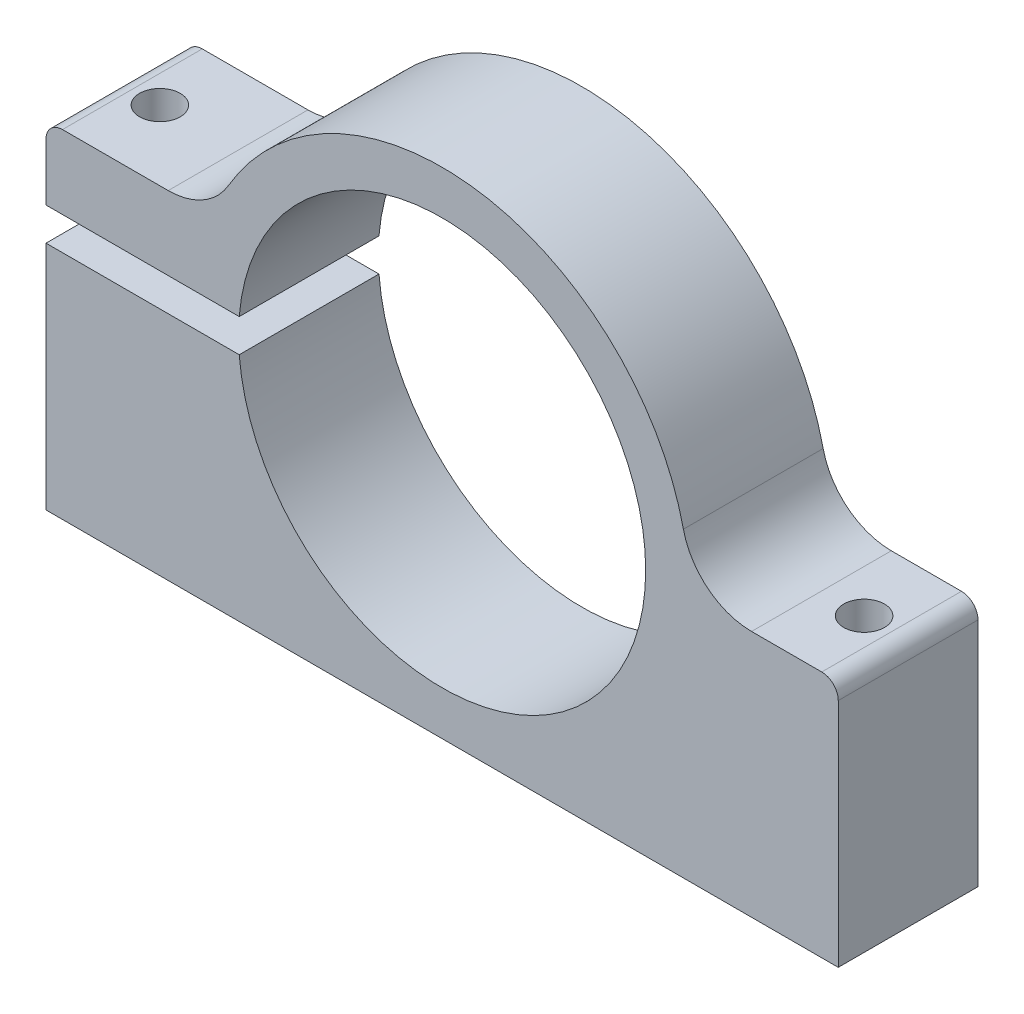
ISO-10303-21;
HEADER;
FILE_DESCRIPTION(('STEP AP214'),'2;1');
FILE_NAME('part.step','',(''),(''),'','','');
FILE_SCHEMA(('AUTOMOTIVE_DESIGN { 1 0 10303 214 1 1 1 1 }'));
ENDSEC;
DATA;
#1=APPLICATION_CONTEXT('core data for automotive mechanical design processes');
#2=APPLICATION_PROTOCOL_DEFINITION('international standard','automotive_design',2000,#1);
#3=PRODUCT_CONTEXT('',#1,'mechanical');
#4=PRODUCT('Part','Part','',(#3));
#5=PRODUCT_RELATED_PRODUCT_CATEGORY('part','',(#4));
#6=PRODUCT_DEFINITION_FORMATION('','',#4);
#7=PRODUCT_DEFINITION_CONTEXT('part definition',#1,'design');
#8=PRODUCT_DEFINITION('design','',#6,#7);
#9=PRODUCT_DEFINITION_SHAPE('','',#8);
#10=(LENGTH_UNIT() NAMED_UNIT(*) SI_UNIT(.MILLI.,.METRE.));
#11=(NAMED_UNIT(*) PLANE_ANGLE_UNIT() SI_UNIT($,.RADIAN.));
#12=(NAMED_UNIT(*) SI_UNIT($,.STERADIAN.) SOLID_ANGLE_UNIT());
#13=UNCERTAINTY_MEASURE_WITH_UNIT(LENGTH_MEASURE(1.E-05),#10,'distance_accuracy_value','');
#14=(GEOMETRIC_REPRESENTATION_CONTEXT(3) GLOBAL_UNCERTAINTY_ASSIGNED_CONTEXT((#13)) GLOBAL_UNIT_ASSIGNED_CONTEXT((#10,
#11,#12)) REPRESENTATION_CONTEXT('',''));
#15=CARTESIAN_POINT('',(0.,0.,0.));
#16=DIRECTION('',(0.,0.,1.));
#17=DIRECTION('',(1.,0.,0.));
#18=AXIS2_PLACEMENT_3D('',#15,#16,#17);
#19=CARTESIAN_POINT('',(-22.4298996876937,1.5,-12.7));
#20=DIRECTION('',(0.,1.,0.));
#21=DIRECTION('',(-1.,0.,0.));
#22=AXIS2_PLACEMENT_3D('',#19,#20,#21);
#23=PLANE('',#22);
#24=CARTESIAN_POINT('',(-32.,1.5,-6.35));
#25=DIRECTION('',(0.,1.,0.));
#26=DIRECTION('',(-1.,0.,0.));
#27=AXIS2_PLACEMENT_3D('',#24,#25,#26);
#28=CIRCLE('',#27,1.85);
#29=CARTESIAN_POINT('',(-33.85,1.5,-6.35));
#30=VERTEX_POINT('',#29);
#31=EDGE_CURVE('E158',#30,#30,#28,.T.);
#32=ORIENTED_EDGE('',*,*,#31,.T.);
#33=EDGE_LOOP('',(#32));
#34=FACE_BOUND('',#33,.T.);
#35=DIRECTION('',(-1.,0.,0.));
#36=VECTOR('',#35,1.);
#37=CARTESIAN_POINT('',(-22.4298996876937,1.5,0.));
#38=LINE('',#37,#36);
#39=CARTESIAN_POINT('',(-18.4390889145858,1.5,0.));
#40=VERTEX_POINT('',#39);
#41=CARTESIAN_POINT('',(-36.,1.5,0.));
#42=VERTEX_POINT('',#41);
#43=EDGE_CURVE('E147',#40,#42,#38,.T.);
#44=ORIENTED_EDGE('',*,*,#43,.T.);
#45=DIRECTION('',(0.,0.,1.));
#46=VECTOR('',#45,1.);
#47=CARTESIAN_POINT('',(-36.,1.5,-12.7));
#48=LINE('',#47,#46);
#49=CARTESIAN_POINT('',(-36.,1.5,-12.7));
#50=VERTEX_POINT('',#49);
#51=EDGE_CURVE('E207',#50,#42,#48,.T.);
#52=ORIENTED_EDGE('',*,*,#51,.F.);
#53=DIRECTION('',(-1.,0.,0.));
#54=VECTOR('',#53,1.);
#55=CARTESIAN_POINT('',(-22.4298996876937,1.5,-12.7));
#56=LINE('',#55,#54);
#57=CARTESIAN_POINT('',(-18.4390889145858,1.50000000000001,-12.7));
#58=VERTEX_POINT('',#57);
#59=EDGE_CURVE('E186',#58,#50,#56,.T.);
#60=ORIENTED_EDGE('',*,*,#59,.F.);
#61=DIRECTION('',(0.,0.,1.));
#62=VECTOR('',#61,1.);
#63=CARTESIAN_POINT('',(-18.4390889145858,1.5,-12.7));
#64=LINE('',#63,#62);
#65=EDGE_CURVE('E157',#58,#40,#64,.T.);
#66=ORIENTED_EDGE('',*,*,#65,.T.);
#67=EDGE_LOOP('',(#44,#52,#60,#66));
#68=FACE_BOUND('',#67,.T.);
#69=ADVANCED_FACE('F36',(#34,#68),#23,.F.);
#70=CARTESIAN_POINT('',(-36.,1.5,-12.7));
#71=DIRECTION('',(1.,0.,0.));
#72=DIRECTION('',(0.,0.,-1.));
#73=AXIS2_PLACEMENT_3D('',#70,#71,#72);
#74=PLANE('',#73);
#75=DIRECTION('',(0.,1.,0.));
#76=VECTOR('',#75,1.);
#77=CARTESIAN_POINT('',(-36.,1.5,0.));
#78=LINE('',#77,#76);
#79=CARTESIAN_POINT('',(-36.,6.69101756633617,0.));
#80=VERTEX_POINT('',#79);
#81=EDGE_CURVE('E204',#42,#80,#78,.T.);
#82=ORIENTED_EDGE('',*,*,#81,.T.);
#83=DIRECTION('',(0.,0.,1.));
#84=VECTOR('',#83,1.);
#85=CARTESIAN_POINT('',(-36.,6.69101756633617,-12.7));
#86=LINE('',#85,#84);
#87=CARTESIAN_POINT('',(-36.,6.69101756633617,-12.7));
#88=VERTEX_POINT('',#87);
#89=EDGE_CURVE('E44',#80,#88,#86,.F.);
#90=ORIENTED_EDGE('',*,*,#89,.T.);
#91=DIRECTION('',(0.,1.,0.));
#92=VECTOR('',#91,1.);
#93=CARTESIAN_POINT('',(-36.,1.5,-12.7));
#94=LINE('',#93,#92);
#95=EDGE_CURVE('E184',#50,#88,#94,.T.);
#96=ORIENTED_EDGE('',*,*,#95,.F.);
#97=ORIENTED_EDGE('',*,*,#51,.T.);
#98=EDGE_LOOP('',(#82,#90,#96,#97));
#99=FACE_BOUND('',#98,.T.);
#100=ADVANCED_FACE('F328',(#99),#74,.F.);
#101=CARTESIAN_POINT('',(-36.,8.19101756633617,-12.7));
#102=DIRECTION('',(0.,-1.,0.));
#103=DIRECTION('',(1.,0.,0.));
#104=AXIS2_PLACEMENT_3D('',#101,#102,#103);
#105=PLANE('',#104);
#106=CARTESIAN_POINT('',(-32.,8.19101756633617,-6.35));
#107=DIRECTION('',(0.,1.,0.));
#108=DIRECTION('',(-1.,0.,0.));
#109=AXIS2_PLACEMENT_3D('',#106,#107,#108);
#110=CIRCLE('',#109,1.85);
#111=CARTESIAN_POINT('',(-33.85,8.19101756633617,-6.35));
#112=VERTEX_POINT('',#111);
#113=EDGE_CURVE('E297',#112,#112,#110,.T.);
#114=ORIENTED_EDGE('',*,*,#113,.F.);
#115=EDGE_LOOP('',(#114));
#116=FACE_BOUND('',#115,.T.);
#117=DIRECTION('',(1.,0.,0.));
#118=VECTOR('',#117,1.);
#119=CARTESIAN_POINT('',(-36.,8.19101756633617,-12.7));
#120=LINE('',#119,#118);
#121=CARTESIAN_POINT('',(-34.5,8.19101756633617,-12.7));
#122=VERTEX_POINT('',#121);
#123=CARTESIAN_POINT('',(-24.8943308432965,8.19101756633617,-12.7));
#124=VERTEX_POINT('',#123);
#125=EDGE_CURVE('E182',#122,#124,#120,.T.);
#126=ORIENTED_EDGE('',*,*,#125,.F.);
#127=DIRECTION('',(0.,0.,1.));
#128=VECTOR('',#127,1.);
#129=CARTESIAN_POINT('',(-34.5,8.19101756633617,-12.7));
#130=LINE('',#129,#128);
#131=CARTESIAN_POINT('',(-34.5,8.19101756633617,0.));
#132=VERTEX_POINT('',#131);
#133=EDGE_CURVE('E249',#122,#132,#130,.T.);
#134=ORIENTED_EDGE('',*,*,#133,.T.);
#135=DIRECTION('',(1.,0.,0.));
#136=VECTOR('',#135,1.);
#137=CARTESIAN_POINT('',(-36.,8.19101756633617,0.));
#138=LINE('',#137,#136);
#139=CARTESIAN_POINT('',(-24.8943308432965,8.19101756633617,0.));
#140=VERTEX_POINT('',#139);
#141=EDGE_CURVE('E202',#132,#140,#138,.T.);
#142=ORIENTED_EDGE('',*,*,#141,.T.);
#143=DIRECTION('',(0.,0.,1.));
#144=VECTOR('',#143,1.);
#145=CARTESIAN_POINT('',(-24.8943308432965,8.19101756633617,-12.7));
#146=LINE('',#145,#144);
#147=EDGE_CURVE('E232',#140,#124,#146,.F.);
#148=ORIENTED_EDGE('',*,*,#147,.T.);
#149=EDGE_LOOP('',(#126,#134,#142,#148));
#150=FACE_BOUND('',#149,.T.);
#151=ADVANCED_FACE('F255',(#116,#150),#105,.F.);
#152=CARTESIAN_POINT('',(0.,0.,-12.7));
#153=DIRECTION('',(0.,0.,1.));
#154=DIRECTION('',(1.,0.,0.));
#155=AXIS2_PLACEMENT_3D('',#152,#153,#154);
#156=CYLINDRICAL_SURFACE('',#155,22.48);
#157=CARTESIAN_POINT('',(0.,0.,-12.7));
#158=DIRECTION('',(0.,0.,1.));
#159=DIRECTION('',(1.,0.,0.));
#160=AXIS2_PLACEMENT_3D('',#157,#158,#159);
#161=CIRCLE('',#160,22.48);
#162=CARTESIAN_POINT('',(21.9279350173925,4.95137010058966,-12.7));
#163=VERTEX_POINT('',#162);
#164=CARTESIAN_POINT('',(-19.4111882538087,11.3382613559222,-12.7));
#165=VERTEX_POINT('',#164);
#166=EDGE_CURVE('E179',#163,#165,#161,.T.);
#167=ORIENTED_EDGE('',*,*,#166,.T.);
#168=DIRECTION('',(0.,0.,1.));
#169=VECTOR('',#168,1.);
#170=CARTESIAN_POINT('',(-19.4111882538087,11.3382613559222,-12.7));
#171=LINE('',#170,#169);
#172=CARTESIAN_POINT('',(-19.4111882538087,11.3382613559222,0.));
#173=VERTEX_POINT('',#172);
#174=EDGE_CURVE('E229',#165,#173,#171,.T.);
#175=ORIENTED_EDGE('',*,*,#174,.T.);
#176=CARTESIAN_POINT('',(0.,0.,0.));
#177=DIRECTION('',(0.,0.,1.));
#178=DIRECTION('',(1.,0.,0.));
#179=AXIS2_PLACEMENT_3D('',#176,#177,#178);
#180=CIRCLE('',#179,22.48);
#181=CARTESIAN_POINT('',(21.9279350173925,4.95137010058966,0.));
#182=VERTEX_POINT('',#181);
#183=EDGE_CURVE('E199',#182,#173,#180,.T.);
#184=ORIENTED_EDGE('',*,*,#183,.F.);
#185=DIRECTION('',(0.,0.,1.));
#186=VECTOR('',#185,1.);
#187=CARTESIAN_POINT('',(21.9279350173925,4.95137010058966,-12.7));
#188=LINE('',#187,#186);
#189=EDGE_CURVE('E222',#182,#163,#188,.F.);
#190=ORIENTED_EDGE('',*,*,#189,.T.);
#191=EDGE_LOOP('',(#167,#175,#184,#190));
#192=FACE_BOUND('',#191,.T.);
#193=ADVANCED_FACE('F268',(#192),#156,.T.);
#194=CARTESIAN_POINT('',(36.,0.,-12.7));
#195=DIRECTION('',(0.,1.,0.));
#196=DIRECTION('',(-1.,0.,0.));
#197=AXIS2_PLACEMENT_3D('',#194,#195,#196);
#198=PLANE('',#197);
#199=CARTESIAN_POINT('',(32.,0.,-6.35));
#200=DIRECTION('',(0.,1.,0.));
#201=DIRECTION('',(-1.,0.,0.));
#202=AXIS2_PLACEMENT_3D('',#199,#200,#201);
#203=CIRCLE('',#202,1.85);
#204=CARTESIAN_POINT('',(30.15,0.,-6.35));
#205=VERTEX_POINT('',#204);
#206=EDGE_CURVE('E303',#205,#205,#203,.T.);
#207=ORIENTED_EDGE('',*,*,#206,.F.);
#208=EDGE_LOOP('',(#207));
#209=FACE_BOUND('',#208,.T.);
#210=DIRECTION('',(-1.,0.,0.));
#211=VECTOR('',#210,1.);
#212=CARTESIAN_POINT('',(36.,0.,0.));
#213=LINE('',#212,#211);
#214=CARTESIAN_POINT('',(34.5,0.,0.));
#215=VERTEX_POINT('',#214);
#216=CARTESIAN_POINT('',(28.1219913946363,0.,0.));
#217=VERTEX_POINT('',#216);
#218=EDGE_CURVE('E197',#215,#217,#213,.T.);
#219=ORIENTED_EDGE('',*,*,#218,.F.);
#220=DIRECTION('',(0.,0.,1.));
#221=VECTOR('',#220,1.);
#222=CARTESIAN_POINT('',(34.5,0.,-12.7));
#223=LINE('',#222,#221);
#224=CARTESIAN_POINT('',(34.5,0.,-12.7));
#225=VERTEX_POINT('',#224);
#226=EDGE_CURVE('E245',#215,#225,#223,.F.);
#227=ORIENTED_EDGE('',*,*,#226,.T.);
#228=DIRECTION('',(-1.,0.,0.));
#229=VECTOR('',#228,1.);
#230=CARTESIAN_POINT('',(36.,0.,-12.7));
#231=LINE('',#230,#229);
#232=CARTESIAN_POINT('',(28.1219913946363,0.,-12.7));
#233=VERTEX_POINT('',#232);
#234=EDGE_CURVE('E177',#225,#233,#231,.T.);
#235=ORIENTED_EDGE('',*,*,#234,.T.);
#236=DIRECTION('',(0.,0.,-1.));
#237=VECTOR('',#236,1.);
#238=CARTESIAN_POINT('',(28.1219913946363,0.,0.));
#239=LINE('',#238,#237);
#240=EDGE_CURVE('E210',#233,#217,#239,.F.);
#241=ORIENTED_EDGE('',*,*,#240,.T.);
#242=EDGE_LOOP('',(#219,#227,#235,#241));
#243=FACE_BOUND('',#242,.T.);
#244=ADVANCED_FACE('F318',(#209,#243),#198,.T.);
#245=CARTESIAN_POINT('',(36.,-22.5,-12.7));
#246=DIRECTION('',(1.,0.,0.));
#247=DIRECTION('',(0.,1.,0.));
#248=AXIS2_PLACEMENT_3D('',#245,#246,#247);
#249=PLANE('',#248);
#250=DIRECTION('',(0.,1.,0.));
#251=VECTOR('',#250,1.);
#252=CARTESIAN_POINT('',(36.,-22.5,-12.7));
#253=LINE('',#252,#251);
#254=CARTESIAN_POINT('',(36.,-22.5,-12.7));
#255=VERTEX_POINT('',#254);
#256=CARTESIAN_POINT('',(36.,-1.5,-12.7));
#257=VERTEX_POINT('',#256);
#258=EDGE_CURVE('E174',#255,#257,#253,.T.);
#259=ORIENTED_EDGE('',*,*,#258,.T.);
#260=DIRECTION('',(0.,0.,1.));
#261=VECTOR('',#260,1.);
#262=CARTESIAN_POINT('',(36.,-1.5,-12.7));
#263=LINE('',#262,#261);
#264=CARTESIAN_POINT('',(36.,-1.5,0.));
#265=VERTEX_POINT('',#264);
#266=EDGE_CURVE('E240',#257,#265,#263,.T.);
#267=ORIENTED_EDGE('',*,*,#266,.T.);
#268=DIRECTION('',(0.,1.,0.));
#269=VECTOR('',#268,1.);
#270=CARTESIAN_POINT('',(36.,-22.5,0.));
#271=LINE('',#270,#269);
#272=CARTESIAN_POINT('',(36.,-22.5,0.));
#273=VERTEX_POINT('',#272);
#274=EDGE_CURVE('E194',#273,#265,#271,.T.);
#275=ORIENTED_EDGE('',*,*,#274,.F.);
#276=DIRECTION('',(0.,0.,1.));
#277=VECTOR('',#276,1.);
#278=CARTESIAN_POINT('',(36.,-22.5,-12.7));
#279=LINE('',#278,#277);
#280=EDGE_CURVE('E211',#255,#273,#279,.T.);
#281=ORIENTED_EDGE('',*,*,#280,.F.);
#282=EDGE_LOOP('',(#259,#267,#275,#281));
#283=FACE_BOUND('',#282,.T.);
#284=ADVANCED_FACE('F284',(#283),#249,.T.);
#285=CARTESIAN_POINT('',(-36.,-22.5,-12.7));
#286=DIRECTION('',(0.,-1.,0.));
#287=DIRECTION('',(0.,0.,-1.));
#288=AXIS2_PLACEMENT_3D('',#285,#286,#287);
#289=PLANE('',#288);
#290=CARTESIAN_POINT('',(32.,-22.5,-6.35));
#291=DIRECTION('',(0.,1.,0.));
#292=DIRECTION('',(-1.,0.,0.));
#293=AXIS2_PLACEMENT_3D('',#290,#291,#292);
#294=CIRCLE('',#293,1.85);
#295=CARTESIAN_POINT('',(30.15,-22.5,-6.35));
#296=VERTEX_POINT('',#295);
#297=EDGE_CURVE('E300',#296,#296,#294,.T.);
#298=ORIENTED_EDGE('',*,*,#297,.T.);
#299=EDGE_LOOP('',(#298));
#300=FACE_BOUND('',#299,.T.);
#301=CARTESIAN_POINT('',(-32.,-22.5,-6.35));
#302=DIRECTION('',(0.,1.,0.));
#303=DIRECTION('',(-1.,0.,0.));
#304=AXIS2_PLACEMENT_3D('',#301,#302,#303);
#305=CIRCLE('',#304,1.85);
#306=CARTESIAN_POINT('',(-33.85,-22.5,-6.35));
#307=VERTEX_POINT('',#306);
#308=EDGE_CURVE('E219',#307,#307,#305,.T.);
#309=ORIENTED_EDGE('',*,*,#308,.T.);
#310=EDGE_LOOP('',(#309));
#311=FACE_BOUND('',#310,.T.);
#312=DIRECTION('',(1.,0.,0.));
#313=VECTOR('',#312,1.);
#314=CARTESIAN_POINT('',(-36.,-22.5,0.));
#315=LINE('',#314,#313);
#316=CARTESIAN_POINT('',(-36.,-22.5,0.));
#317=VERTEX_POINT('',#316);
#318=EDGE_CURVE('E191',#317,#273,#315,.T.);
#319=ORIENTED_EDGE('',*,*,#318,.F.);
#320=DIRECTION('',(0.,0.,1.));
#321=VECTOR('',#320,1.);
#322=CARTESIAN_POINT('',(-36.,-22.5,-12.7));
#323=LINE('',#322,#321);
#324=CARTESIAN_POINT('',(-36.,-22.5,-12.7));
#325=VERTEX_POINT('',#324);
#326=EDGE_CURVE('E213',#325,#317,#323,.T.);
#327=ORIENTED_EDGE('',*,*,#326,.F.);
#328=DIRECTION('',(1.,0.,0.));
#329=VECTOR('',#328,1.);
#330=CARTESIAN_POINT('',(-36.,-22.5,-12.7));
#331=LINE('',#330,#329);
#332=EDGE_CURVE('E171',#325,#255,#331,.T.);
#333=ORIENTED_EDGE('',*,*,#332,.T.);
#334=ORIENTED_EDGE('',*,*,#280,.T.);
#335=EDGE_LOOP('',(#319,#327,#333,#334));
#336=FACE_BOUND('',#335,.T.);
#337=ADVANCED_FACE('F289',(#300,#311,#336),#289,.T.);
#338=CARTESIAN_POINT('',(-36.,-1.5,-12.7));
#339=DIRECTION('',(-1.,0.,0.));
#340=DIRECTION('',(0.,-1.,0.));
#341=AXIS2_PLACEMENT_3D('',#338,#339,#340);
#342=PLANE('',#341);
#343=DIRECTION('',(0.,-1.,0.));
#344=VECTOR('',#343,1.);
#345=CARTESIAN_POINT('',(-36.,-1.5,0.));
#346=LINE('',#345,#344);
#347=CARTESIAN_POINT('',(-36.,-1.5,0.));
#348=VERTEX_POINT('',#347);
#349=EDGE_CURVE('E165',#348,#317,#346,.T.);
#350=ORIENTED_EDGE('',*,*,#349,.F.);
#351=DIRECTION('',(0.,0.,1.));
#352=VECTOR('',#351,1.);
#353=CARTESIAN_POINT('',(-36.,-1.5,-12.7));
#354=LINE('',#353,#352);
#355=CARTESIAN_POINT('',(-36.,-1.5,-12.7));
#356=VERTEX_POINT('',#355);
#357=EDGE_CURVE('E187',#356,#348,#354,.T.);
#358=ORIENTED_EDGE('',*,*,#357,.F.);
#359=DIRECTION('',(0.,-1.,0.));
#360=VECTOR('',#359,1.);
#361=CARTESIAN_POINT('',(-36.,-1.5,-12.7));
#362=LINE('',#361,#360);
#363=EDGE_CURVE('E145',#356,#325,#362,.T.);
#364=ORIENTED_EDGE('',*,*,#363,.T.);
#365=ORIENTED_EDGE('',*,*,#326,.T.);
#366=EDGE_LOOP('',(#350,#358,#364,#365));
#367=FACE_BOUND('',#366,.T.);
#368=ADVANCED_FACE('F291',(#367),#342,.T.);
#369=CARTESIAN_POINT('',(-22.4298996876937,-1.5,-12.7));
#370=DIRECTION('',(0.,1.,0.));
#371=DIRECTION('',(-1.,0.,0.));
#372=AXIS2_PLACEMENT_3D('',#369,#370,#371);
#373=PLANE('',#372);
#374=CARTESIAN_POINT('',(-32.,-1.5,-6.35));
#375=DIRECTION('',(0.,1.,0.));
#376=DIRECTION('',(-1.,0.,0.));
#377=AXIS2_PLACEMENT_3D('',#374,#375,#376);
#378=CIRCLE('',#377,1.85);
#379=CARTESIAN_POINT('',(-33.85,-1.5,-6.35));
#380=VERTEX_POINT('',#379);
#381=EDGE_CURVE('E216',#380,#380,#378,.T.);
#382=ORIENTED_EDGE('',*,*,#381,.F.);
#383=EDGE_LOOP('',(#382));
#384=FACE_BOUND('',#383,.T.);
#385=DIRECTION('',(-1.,0.,0.));
#386=VECTOR('',#385,1.);
#387=CARTESIAN_POINT('',(-22.4298996876937,-1.5,0.));
#388=LINE('',#387,#386);
#389=CARTESIAN_POINT('',(-18.4390889145858,-1.50000000000005,0.));
#390=VERTEX_POINT('',#389);
#391=EDGE_CURVE('E153',#390,#348,#388,.T.);
#392=ORIENTED_EDGE('',*,*,#391,.F.);
#393=DIRECTION('',(0.,0.,1.));
#394=VECTOR('',#393,1.);
#395=CARTESIAN_POINT('',(-18.4390889145858,-1.5,-12.7));
#396=LINE('',#395,#394);
#397=CARTESIAN_POINT('',(-18.4390889145858,-1.5,-12.7));
#398=VERTEX_POINT('',#397);
#399=EDGE_CURVE('E150',#398,#390,#396,.T.);
#400=ORIENTED_EDGE('',*,*,#399,.F.);
#401=DIRECTION('',(-1.,0.,0.));
#402=VECTOR('',#401,1.);
#403=CARTESIAN_POINT('',(-22.4298996876937,-1.5,-12.7));
#404=LINE('',#403,#402);
#405=EDGE_CURVE('E138',#398,#356,#404,.T.);
#406=ORIENTED_EDGE('',*,*,#405,.T.);
#407=ORIENTED_EDGE('',*,*,#357,.T.);
#408=EDGE_LOOP('',(#392,#400,#406,#407));
#409=FACE_BOUND('',#408,.T.);
#410=ADVANCED_FACE('F151',(#384,#409),#373,.T.);
#411=CARTESIAN_POINT('',(0.,0.,-12.7));
#412=DIRECTION('',(0.,0.,1.));
#413=DIRECTION('',(1.,0.,0.));
#414=AXIS2_PLACEMENT_3D('',#411,#412,#413);
#415=PLANE('',#414);
#416=ORIENTED_EDGE('',*,*,#95,.T.);
#417=CARTESIAN_POINT('',(-34.5,6.69101756633617,-12.7));
#418=DIRECTION('',(0.,0.,1.));
#419=DIRECTION('',(1.,0.,0.));
#420=AXIS2_PLACEMENT_3D('',#417,#418,#419);
#421=CIRCLE('',#420,1.5);
#422=EDGE_CURVE('E11',#88,#122,#421,.F.);
#423=ORIENTED_EDGE('',*,*,#422,.T.);
#424=ORIENTED_EDGE('',*,*,#125,.T.);
#425=CARTESIAN_POINT('',(-24.8943308432965,14.5410175663362,-12.7));
#426=DIRECTION('',(0.,0.,1.));
#427=DIRECTION('',(1.,0.,0.));
#428=AXIS2_PLACEMENT_3D('',#425,#426,#427);
#429=CIRCLE('',#428,6.35);
#430=EDGE_CURVE('E238',#124,#165,#429,.T.);
#431=ORIENTED_EDGE('',*,*,#430,.T.);
#432=ORIENTED_EDGE('',*,*,#166,.F.);
#433=CARTESIAN_POINT('',(28.1219913946363,6.35,-12.7));
#434=DIRECTION('',(0.,0.,1.));
#435=DIRECTION('',(1.,0.,0.));
#436=AXIS2_PLACEMENT_3D('',#433,#434,#435);
#437=CIRCLE('',#436,6.35);
#438=EDGE_CURVE('E226',#163,#233,#437,.T.);
#439=ORIENTED_EDGE('',*,*,#438,.T.);
#440=ORIENTED_EDGE('',*,*,#234,.F.);
#441=CARTESIAN_POINT('',(34.5,-1.5,-12.7));
#442=DIRECTION('',(0.,0.,1.));
#443=DIRECTION('',(1.,0.,0.));
#444=AXIS2_PLACEMENT_3D('',#441,#442,#443);
#445=CIRCLE('',#444,1.5);
#446=EDGE_CURVE('E247',#225,#257,#445,.F.);
#447=ORIENTED_EDGE('',*,*,#446,.T.);
#448=ORIENTED_EDGE('',*,*,#258,.F.);
#449=ORIENTED_EDGE('',*,*,#332,.F.);
#450=ORIENTED_EDGE('',*,*,#363,.F.);
#451=ORIENTED_EDGE('',*,*,#405,.F.);
#452=CARTESIAN_POINT('',(0.,0.,-12.7));
#453=DIRECTION('',(0.,0.,1.));
#454=DIRECTION('',(1.,0.,0.));
#455=AXIS2_PLACEMENT_3D('',#452,#453,#454);
#456=CIRCLE('',#455,18.5);
#457=EDGE_CURVE('E142',#398,#58,#456,.T.);
#458=ORIENTED_EDGE('',*,*,#457,.T.);
#459=ORIENTED_EDGE('',*,*,#59,.T.);
#460=EDGE_LOOP('',(#416,#423,#424,#431,#432,#439,#440,#447,#448,#449,#450,#451,#458,#459));
#461=FACE_BOUND('',#460,.T.);
#462=ADVANCED_FACE('F140',(#461),#415,.F.);
#463=CARTESIAN_POINT('',(0.,0.,0.));
#464=DIRECTION('',(0.,0.,1.));
#465=DIRECTION('',(1.,0.,0.));
#466=AXIS2_PLACEMENT_3D('',#463,#464,#465);
#467=PLANE('',#466);
#468=ORIENTED_EDGE('',*,*,#141,.F.);
#469=CARTESIAN_POINT('',(-34.5,6.69101756633617,0.));
#470=DIRECTION('',(0.,0.,1.));
#471=DIRECTION('',(1.,0.,0.));
#472=AXIS2_PLACEMENT_3D('',#469,#470,#471);
#473=CIRCLE('',#472,1.5);
#474=EDGE_CURVE('E58',#132,#80,#473,.T.);
#475=ORIENTED_EDGE('',*,*,#474,.T.);
#476=ORIENTED_EDGE('',*,*,#81,.F.);
#477=ORIENTED_EDGE('',*,*,#43,.F.);
#478=CARTESIAN_POINT('',(0.,0.,0.));
#479=DIRECTION('',(0.,0.,1.));
#480=DIRECTION('',(1.,0.,0.));
#481=AXIS2_PLACEMENT_3D('',#478,#479,#480);
#482=CIRCLE('',#481,18.5);
#483=EDGE_CURVE('E163',#390,#40,#482,.T.);
#484=ORIENTED_EDGE('',*,*,#483,.F.);
#485=ORIENTED_EDGE('',*,*,#391,.T.);
#486=ORIENTED_EDGE('',*,*,#349,.T.);
#487=ORIENTED_EDGE('',*,*,#318,.T.);
#488=ORIENTED_EDGE('',*,*,#274,.T.);
#489=CARTESIAN_POINT('',(34.5,-1.5,0.));
#490=DIRECTION('',(0.,0.,1.));
#491=DIRECTION('',(1.,0.,0.));
#492=AXIS2_PLACEMENT_3D('',#489,#490,#491);
#493=CIRCLE('',#492,1.5);
#494=EDGE_CURVE('E243',#265,#215,#493,.T.);
#495=ORIENTED_EDGE('',*,*,#494,.T.);
#496=ORIENTED_EDGE('',*,*,#218,.T.);
#497=CARTESIAN_POINT('',(28.1219913946363,6.35,0.));
#498=DIRECTION('',(0.,0.,1.));
#499=DIRECTION('',(1.,0.,0.));
#500=AXIS2_PLACEMENT_3D('',#497,#498,#499);
#501=CIRCLE('',#500,6.35);
#502=EDGE_CURVE('E224',#217,#182,#501,.F.);
#503=ORIENTED_EDGE('',*,*,#502,.T.);
#504=ORIENTED_EDGE('',*,*,#183,.T.);
#505=CARTESIAN_POINT('',(-24.8943308432965,14.5410175663362,0.));
#506=DIRECTION('',(0.,0.,1.));
#507=DIRECTION('',(1.,0.,0.));
#508=AXIS2_PLACEMENT_3D('',#505,#506,#507);
#509=CIRCLE('',#508,6.35);
#510=EDGE_CURVE('E235',#173,#140,#509,.F.);
#511=ORIENTED_EDGE('',*,*,#510,.T.);
#512=EDGE_LOOP('',(#468,#475,#476,#477,#484,#485,#486,#487,#488,#495,#496,#503,#504,#511));
#513=FACE_BOUND('',#512,.T.);
#514=ADVANCED_FACE('F258',(#513),#467,.T.);
#515=CARTESIAN_POINT('',(0.,0.,-12.7));
#516=DIRECTION('',(0.,0.,1.));
#517=DIRECTION('',(1.,0.,0.));
#518=AXIS2_PLACEMENT_3D('',#515,#516,#517);
#519=CYLINDRICAL_SURFACE('',#518,18.5);
#520=ORIENTED_EDGE('',*,*,#483,.T.);
#521=ORIENTED_EDGE('',*,*,#65,.F.);
#522=ORIENTED_EDGE('',*,*,#457,.F.);
#523=ORIENTED_EDGE('',*,*,#399,.T.);
#524=EDGE_LOOP('',(#520,#521,#522,#523));
#525=FACE_BOUND('',#524,.T.);
#526=ADVANCED_FACE('F161',(#525),#519,.F.);
#527=CARTESIAN_POINT('',(-32.,-22.5,-6.35));
#528=DIRECTION('',(0.,1.,0.));
#529=DIRECTION('',(-1.,0.,0.));
#530=AXIS2_PLACEMENT_3D('',#527,#528,#529);
#531=CYLINDRICAL_SURFACE('',#530,1.85);
#532=ORIENTED_EDGE('',*,*,#381,.T.);
#533=EDGE_LOOP('',(#532));
#534=FACE_BOUND('',#533,.T.);
#535=ORIENTED_EDGE('',*,*,#308,.F.);
#536=EDGE_LOOP('',(#535));
#537=FACE_BOUND('',#536,.T.);
#538=ADVANCED_FACE('F346',(#534,#537),#531,.F.);
#539=ORIENTED_EDGE('',*,*,#113,.T.);
#540=EDGE_LOOP('',(#539));
#541=FACE_BOUND('',#540,.T.);
#542=ORIENTED_EDGE('',*,*,#31,.F.);
#543=EDGE_LOOP('',(#542));
#544=FACE_BOUND('',#543,.T.);
#545=ADVANCED_FACE('F314',(#541,#544),#531,.F.);
#546=CARTESIAN_POINT('',(32.,-22.5,-6.35));
#547=DIRECTION('',(0.,1.,0.));
#548=DIRECTION('',(-1.,0.,0.));
#549=AXIS2_PLACEMENT_3D('',#546,#547,#548);
#550=CYLINDRICAL_SURFACE('',#549,1.85);
#551=ORIENTED_EDGE('',*,*,#297,.F.);
#552=EDGE_LOOP('',(#551));
#553=FACE_BOUND('',#552,.T.);
#554=ORIENTED_EDGE('',*,*,#206,.T.);
#555=EDGE_LOOP('',(#554));
#556=FACE_BOUND('',#555,.T.);
#557=ADVANCED_FACE('F311',(#553,#556),#550,.F.);
#558=CARTESIAN_POINT('',(28.1219913946363,6.35,-12.7));
#559=DIRECTION('',(0.,0.,1.));
#560=DIRECTION('',(1.,0.,0.));
#561=AXIS2_PLACEMENT_3D('',#558,#559,#560);
#562=CYLINDRICAL_SURFACE('',#561,6.35);
#563=ORIENTED_EDGE('',*,*,#438,.F.);
#564=ORIENTED_EDGE('',*,*,#189,.F.);
#565=ORIENTED_EDGE('',*,*,#502,.F.);
#566=ORIENTED_EDGE('',*,*,#240,.F.);
#567=EDGE_LOOP('',(#563,#564,#565,#566));
#568=FACE_BOUND('',#567,.T.);
#569=ADVANCED_FACE('F272',(#568),#562,.F.);
#570=CARTESIAN_POINT('',(-24.8943308432965,14.5410175663362,-12.7));
#571=DIRECTION('',(0.,0.,1.));
#572=DIRECTION('',(1.,0.,0.));
#573=AXIS2_PLACEMENT_3D('',#570,#571,#572);
#574=CYLINDRICAL_SURFACE('',#573,6.35);
#575=ORIENTED_EDGE('',*,*,#430,.F.);
#576=ORIENTED_EDGE('',*,*,#147,.F.);
#577=ORIENTED_EDGE('',*,*,#510,.F.);
#578=ORIENTED_EDGE('',*,*,#174,.F.);
#579=EDGE_LOOP('',(#575,#576,#577,#578));
#580=FACE_BOUND('',#579,.T.);
#581=ADVANCED_FACE('F264',(#580),#574,.F.);
#582=CARTESIAN_POINT('',(34.5,-1.5,-12.7));
#583=DIRECTION('',(0.,0.,1.));
#584=DIRECTION('',(1.,0.,0.));
#585=AXIS2_PLACEMENT_3D('',#582,#583,#584);
#586=CYLINDRICAL_SURFACE('',#585,1.5);
#587=ORIENTED_EDGE('',*,*,#446,.F.);
#588=ORIENTED_EDGE('',*,*,#226,.F.);
#589=ORIENTED_EDGE('',*,*,#494,.F.);
#590=ORIENTED_EDGE('',*,*,#266,.F.);
#591=EDGE_LOOP('',(#587,#588,#589,#590));
#592=FACE_BOUND('',#591,.T.);
#593=ADVANCED_FACE('F281',(#592),#586,.T.);
#594=CARTESIAN_POINT('',(-34.5,6.69101756633617,-12.7));
#595=DIRECTION('',(0.,0.,1.));
#596=DIRECTION('',(1.,0.,0.));
#597=AXIS2_PLACEMENT_3D('',#594,#595,#596);
#598=CYLINDRICAL_SURFACE('',#597,1.5);
#599=ORIENTED_EDGE('',*,*,#422,.F.);
#600=ORIENTED_EDGE('',*,*,#89,.F.);
#601=ORIENTED_EDGE('',*,*,#474,.F.);
#602=ORIENTED_EDGE('',*,*,#133,.F.);
#603=EDGE_LOOP('',(#599,#600,#601,#602));
#604=FACE_BOUND('',#603,.T.);
#605=ADVANCED_FACE('F38',(#604),#598,.T.);
#606=CLOSED_SHELL('',(#69,#100,#151,#193,#244,#284,#337,#368,#410,#462,#514,#526,#538,#545,#557,
#569,#581,#593,#605));
#607=MANIFOLD_SOLID_BREP('B2',#606);
#608=ADVANCED_BREP_SHAPE_REPRESENTATION('',(#18,#607),#14);
#609=SHAPE_DEFINITION_REPRESENTATION(#9,#608);
ENDSEC;
END-ISO-10303-21;
